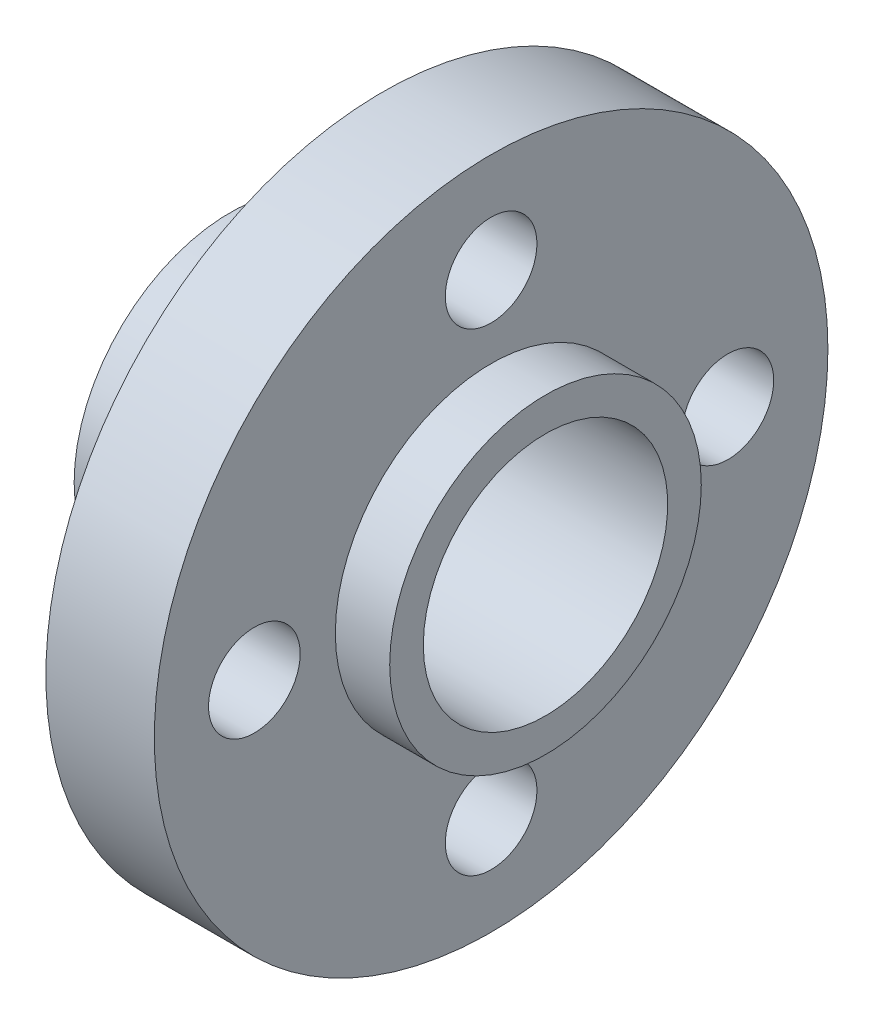
ISO-10303-21;
HEADER;
FILE_DESCRIPTION(('STEP AP214'),'2;1');
FILE_NAME('part.step','',(''),(''),'','','');
FILE_SCHEMA(('AUTOMOTIVE_DESIGN { 1 0 10303 214 1 1 1 1 }'));
ENDSEC;
DATA;
#1=APPLICATION_CONTEXT('core data for automotive mechanical design processes');
#2=APPLICATION_PROTOCOL_DEFINITION('international standard','automotive_design',2000,#1);
#3=PRODUCT_CONTEXT('',#1,'mechanical');
#4=PRODUCT('Part','Part','',(#3));
#5=PRODUCT_RELATED_PRODUCT_CATEGORY('part','',(#4));
#6=PRODUCT_DEFINITION_FORMATION('','',#4);
#7=PRODUCT_DEFINITION_CONTEXT('part definition',#1,'design');
#8=PRODUCT_DEFINITION('design','',#6,#7);
#9=PRODUCT_DEFINITION_SHAPE('','',#8);
#10=(LENGTH_UNIT() NAMED_UNIT(*) SI_UNIT(.MILLI.,.METRE.));
#11=(NAMED_UNIT(*) PLANE_ANGLE_UNIT() SI_UNIT($,.RADIAN.));
#12=(NAMED_UNIT(*) SI_UNIT($,.STERADIAN.) SOLID_ANGLE_UNIT());
#13=UNCERTAINTY_MEASURE_WITH_UNIT(LENGTH_MEASURE(1.E-05),#10,'distance_accuracy_value','');
#14=(GEOMETRIC_REPRESENTATION_CONTEXT(3) GLOBAL_UNCERTAINTY_ASSIGNED_CONTEXT((#13)) GLOBAL_UNIT_ASSIGNED_CONTEXT((#10,
#11,#12)) REPRESENTATION_CONTEXT('',''));
#15=CARTESIAN_POINT('',(0.,0.,0.));
#16=DIRECTION('',(0.,0.,1.));
#17=DIRECTION('',(1.,0.,0.));
#18=AXIS2_PLACEMENT_3D('',#15,#16,#17);
#19=CARTESIAN_POINT('',(3.55,0.,0.));
#20=DIRECTION('',(-1.,0.,0.));
#21=DIRECTION('',(0.,0.,1.));
#22=AXIS2_PLACEMENT_3D('',#19,#20,#21);
#23=CYLINDRICAL_SURFACE('',#22,11.025);
#24=CARTESIAN_POINT('',(3.55,0.,0.));
#25=DIRECTION('',(1.,0.,0.));
#26=DIRECTION('',(0.,0.,-1.));
#27=AXIS2_PLACEMENT_3D('',#24,#25,#26);
#28=CIRCLE('',#27,11.025);
#29=CARTESIAN_POINT('',(3.55,0.,-11.025));
#30=VERTEX_POINT('',#29);
#31=EDGE_CURVE('E39',#30,#30,#28,.T.);
#32=ORIENTED_EDGE('',*,*,#31,.F.);
#33=EDGE_LOOP('',(#32));
#34=FACE_BOUND('',#33,.T.);
#35=CARTESIAN_POINT('',(0.,0.,0.));
#36=DIRECTION('',(1.,0.,0.));
#37=DIRECTION('',(0.,0.,-1.));
#38=AXIS2_PLACEMENT_3D('',#35,#36,#37);
#39=CIRCLE('',#38,11.025);
#40=CARTESIAN_POINT('',(0.,0.,-11.025));
#41=VERTEX_POINT('',#40);
#42=EDGE_CURVE('E43',#41,#41,#39,.T.);
#43=ORIENTED_EDGE('',*,*,#42,.T.);
#44=EDGE_LOOP('',(#43));
#45=FACE_BOUND('',#44,.T.);
#46=ADVANCED_FACE('F33',(#34,#45),#23,.T.);
#47=CARTESIAN_POINT('',(3.55,0.,0.));
#48=DIRECTION('',(1.,0.,0.));
#49=DIRECTION('',(0.,0.,-1.));
#50=AXIS2_PLACEMENT_3D('',#47,#48,#49);
#51=PLANE('',#50);
#52=CARTESIAN_POINT('',(3.55,0.,7.75));
#53=DIRECTION('',(1.,0.,0.));
#54=DIRECTION('',(0.,0.,-1.));
#55=AXIS2_PLACEMENT_3D('',#52,#53,#54);
#56=CIRCLE('',#55,1.5);
#57=CARTESIAN_POINT('',(3.55,0.,6.25));
#58=VERTEX_POINT('',#57);
#59=EDGE_CURVE('E76',#58,#58,#56,.T.);
#60=ORIENTED_EDGE('',*,*,#59,.F.);
#61=EDGE_LOOP('',(#60));
#62=FACE_BOUND('',#61,.T.);
#63=CARTESIAN_POINT('',(3.55,7.75,0.));
#64=DIRECTION('',(1.,0.,0.));
#65=DIRECTION('',(0.,0.,-1.));
#66=AXIS2_PLACEMENT_3D('',#63,#64,#65);
#67=CIRCLE('',#66,1.5);
#68=CARTESIAN_POINT('',(3.55,7.75,-1.50000000000008));
#69=VERTEX_POINT('',#68);
#70=EDGE_CURVE('E79',#69,#69,#67,.T.);
#71=ORIENTED_EDGE('',*,*,#70,.F.);
#72=EDGE_LOOP('',(#71));
#73=FACE_BOUND('',#72,.T.);
#74=CARTESIAN_POINT('',(3.55,-7.75,0.));
#75=DIRECTION('',(1.,0.,0.));
#76=DIRECTION('',(0.,0.,-1.));
#77=AXIS2_PLACEMENT_3D('',#74,#75,#76);
#78=CIRCLE('',#77,1.5);
#79=CARTESIAN_POINT('',(3.55,-7.75,-1.49999999999997));
#80=VERTEX_POINT('',#79);
#81=EDGE_CURVE('E70',#80,#80,#78,.T.);
#82=ORIENTED_EDGE('',*,*,#81,.F.);
#83=EDGE_LOOP('',(#82));
#84=FACE_BOUND('',#83,.T.);
#85=CARTESIAN_POINT('',(3.55,0.,-7.75));
#86=DIRECTION('',(1.,0.,0.));
#87=DIRECTION('',(0.,0.,-1.));
#88=AXIS2_PLACEMENT_3D('',#85,#86,#87);
#89=CIRCLE('',#88,1.5);
#90=CARTESIAN_POINT('',(3.55,0.,-9.25));
#91=VERTEX_POINT('',#90);
#92=EDGE_CURVE('E62',#91,#91,#89,.T.);
#93=ORIENTED_EDGE('',*,*,#92,.F.);
#94=EDGE_LOOP('',(#93));
#95=FACE_BOUND('',#94,.T.);
#96=CARTESIAN_POINT('',(3.55,0.,0.));
#97=DIRECTION('',(1.,0.,0.));
#98=DIRECTION('',(0.,0.,-1.));
#99=AXIS2_PLACEMENT_3D('',#96,#97,#98);
#100=CIRCLE('',#99,5.1);
#101=CARTESIAN_POINT('',(3.55,0.,-5.1));
#102=VERTEX_POINT('',#101);
#103=EDGE_CURVE('E50',#102,#102,#100,.T.);
#104=ORIENTED_EDGE('',*,*,#103,.F.);
#105=EDGE_LOOP('',(#104));
#106=FACE_BOUND('',#105,.T.);
#107=ORIENTED_EDGE('',*,*,#31,.T.);
#108=EDGE_LOOP('',(#107));
#109=FACE_BOUND('',#108,.T.);
#110=ADVANCED_FACE('F95',(#62,#73,#84,#95,#106,#109),#51,.T.);
#111=CARTESIAN_POINT('',(0.,0.,0.));
#112=DIRECTION('',(1.,0.,0.));
#113=DIRECTION('',(0.,0.,-1.));
#114=AXIS2_PLACEMENT_3D('',#111,#112,#113);
#115=PLANE('',#114);
#116=CARTESIAN_POINT('',(0.,0.,7.75));
#117=DIRECTION('',(-1.,0.,0.));
#118=DIRECTION('',(0.,0.,-1.));
#119=AXIS2_PLACEMENT_3D('',#116,#117,#118);
#120=CIRCLE('',#119,1.5);
#121=CARTESIAN_POINT('',(0.,0.,6.25));
#122=VERTEX_POINT('',#121);
#123=EDGE_CURVE('E82',#122,#122,#120,.T.);
#124=ORIENTED_EDGE('',*,*,#123,.F.);
#125=EDGE_LOOP('',(#124));
#126=FACE_BOUND('',#125,.T.);
#127=CARTESIAN_POINT('',(0.,7.75,0.));
#128=DIRECTION('',(-1.,0.,0.));
#129=DIRECTION('',(0.,-1.,0.));
#130=AXIS2_PLACEMENT_3D('',#127,#128,#129);
#131=CIRCLE('',#130,1.5);
#132=CARTESIAN_POINT('',(0.,6.25,0.));
#133=VERTEX_POINT('',#132);
#134=EDGE_CURVE('E83',#133,#133,#131,.T.);
#135=ORIENTED_EDGE('',*,*,#134,.F.);
#136=EDGE_LOOP('',(#135));
#137=FACE_BOUND('',#136,.T.);
#138=CARTESIAN_POINT('',(0.,-7.75,0.));
#139=DIRECTION('',(-1.,0.,0.));
#140=DIRECTION('',(0.,1.,0.));
#141=AXIS2_PLACEMENT_3D('',#138,#139,#140);
#142=CIRCLE('',#141,1.5);
#143=CARTESIAN_POINT('',(0.,-6.25,0.));
#144=VERTEX_POINT('',#143);
#145=EDGE_CURVE('E73',#144,#144,#142,.T.);
#146=ORIENTED_EDGE('',*,*,#145,.F.);
#147=EDGE_LOOP('',(#146));
#148=FACE_BOUND('',#147,.T.);
#149=CARTESIAN_POINT('',(0.,0.,-7.75));
#150=DIRECTION('',(-1.,0.,0.));
#151=DIRECTION('',(0.,0.,1.));
#152=AXIS2_PLACEMENT_3D('',#149,#150,#151);
#153=CIRCLE('',#152,1.5);
#154=CARTESIAN_POINT('',(0.,0.,-6.25));
#155=VERTEX_POINT('',#154);
#156=EDGE_CURVE('E67',#155,#155,#153,.T.);
#157=ORIENTED_EDGE('',*,*,#156,.F.);
#158=EDGE_LOOP('',(#157));
#159=FACE_BOUND('',#158,.T.);
#160=CARTESIAN_POINT('',(0.,0.,0.));
#161=DIRECTION('',(1.,0.,0.));
#162=DIRECTION('',(0.,0.,-1.));
#163=AXIS2_PLACEMENT_3D('',#160,#161,#162);
#164=CIRCLE('',#163,5.1);
#165=CARTESIAN_POINT('',(0.,0.,-5.1));
#166=VERTEX_POINT('',#165);
#167=EDGE_CURVE('E10',#166,#166,#164,.F.);
#168=ORIENTED_EDGE('',*,*,#167,.F.);
#169=EDGE_LOOP('',(#168));
#170=FACE_BOUND('',#169,.T.);
#171=ORIENTED_EDGE('',*,*,#42,.F.);
#172=EDGE_LOOP('',(#171));
#173=FACE_BOUND('',#172,.T.);
#174=ADVANCED_FACE('F91',(#126,#137,#148,#159,#170,#173),#115,.F.);
#175=CARTESIAN_POINT('',(5.33,0.,0.));
#176=DIRECTION('',(-1.,0.,0.));
#177=DIRECTION('',(0.,0.,1.));
#178=AXIS2_PLACEMENT_3D('',#175,#176,#177);
#179=CYLINDRICAL_SURFACE('',#178,5.1);
#180=CARTESIAN_POINT('',(5.33,0.,0.));
#181=DIRECTION('',(1.,0.,0.));
#182=DIRECTION('',(0.,0.,-1.));
#183=AXIS2_PLACEMENT_3D('',#180,#181,#182);
#184=CIRCLE('',#183,5.1);
#185=CARTESIAN_POINT('',(5.33,0.,-5.1));
#186=VERTEX_POINT('',#185);
#187=EDGE_CURVE('E48',#186,#186,#184,.T.);
#188=ORIENTED_EDGE('',*,*,#187,.F.);
#189=EDGE_LOOP('',(#188));
#190=FACE_BOUND('',#189,.T.);
#191=ORIENTED_EDGE('',*,*,#103,.T.);
#192=EDGE_LOOP('',(#191));
#193=FACE_BOUND('',#192,.T.);
#194=ADVANCED_FACE('F94',(#190,#193),#179,.T.);
#195=CARTESIAN_POINT('',(5.33,0.,0.));
#196=DIRECTION('',(1.,0.,0.));
#197=DIRECTION('',(0.,0.,-1.));
#198=AXIS2_PLACEMENT_3D('',#195,#196,#197);
#199=PLANE('',#198);
#200=CARTESIAN_POINT('',(5.33,0.,0.));
#201=DIRECTION('',(-1.,0.,0.));
#202=DIRECTION('',(0.,0.,1.));
#203=AXIS2_PLACEMENT_3D('',#200,#201,#202);
#204=CIRCLE('',#203,4.);
#205=CARTESIAN_POINT('',(5.33,0.,4.));
#206=VERTEX_POINT('',#205);
#207=EDGE_CURVE('E58',#206,#206,#204,.T.);
#208=ORIENTED_EDGE('',*,*,#207,.T.);
#209=EDGE_LOOP('',(#208));
#210=FACE_BOUND('',#209,.T.);
#211=ORIENTED_EDGE('',*,*,#187,.T.);
#212=EDGE_LOOP('',(#211));
#213=FACE_BOUND('',#212,.T.);
#214=ADVANCED_FACE('F119',(#210,#213),#199,.T.);
#215=CARTESIAN_POINT('',(-5.,0.,0.));
#216=DIRECTION('',(1.,0.,0.));
#217=DIRECTION('',(0.,0.,-1.));
#218=AXIS2_PLACEMENT_3D('',#215,#216,#217);
#219=CYLINDRICAL_SURFACE('',#218,5.1);
#220=CARTESIAN_POINT('',(-5.,0.,0.));
#221=DIRECTION('',(-1.,0.,0.));
#222=DIRECTION('',(0.,0.,1.));
#223=AXIS2_PLACEMENT_3D('',#220,#221,#222);
#224=CIRCLE('',#223,5.1);
#225=CARTESIAN_POINT('',(-5.,0.,5.1));
#226=VERTEX_POINT('',#225);
#227=EDGE_CURVE('E53',#226,#226,#224,.T.);
#228=ORIENTED_EDGE('',*,*,#227,.F.);
#229=EDGE_LOOP('',(#228));
#230=FACE_BOUND('',#229,.T.);
#231=ORIENTED_EDGE('',*,*,#167,.T.);
#232=EDGE_LOOP('',(#231));
#233=FACE_BOUND('',#232,.T.);
#234=ADVANCED_FACE('F123',(#230,#233),#219,.T.);
#235=CARTESIAN_POINT('',(-5.,0.,0.));
#236=DIRECTION('',(-1.,0.,0.));
#237=DIRECTION('',(0.,0.,1.));
#238=AXIS2_PLACEMENT_3D('',#235,#236,#237);
#239=PLANE('',#238);
#240=CARTESIAN_POINT('',(-5.,0.,0.));
#241=DIRECTION('',(-1.,0.,0.));
#242=DIRECTION('',(0.,0.,1.));
#243=AXIS2_PLACEMENT_3D('',#240,#241,#242);
#244=CIRCLE('',#243,4.);
#245=CARTESIAN_POINT('',(-5.,0.,4.));
#246=VERTEX_POINT('',#245);
#247=EDGE_CURVE('E59',#246,#246,#244,.T.);
#248=ORIENTED_EDGE('',*,*,#247,.F.);
#249=EDGE_LOOP('',(#248));
#250=FACE_BOUND('',#249,.T.);
#251=ORIENTED_EDGE('',*,*,#227,.T.);
#252=EDGE_LOOP('',(#251));
#253=FACE_BOUND('',#252,.T.);
#254=ADVANCED_FACE('F127',(#250,#253),#239,.T.);
#255=CARTESIAN_POINT('',(5.33,0.,0.));
#256=DIRECTION('',(-1.,0.,0.));
#257=DIRECTION('',(0.,0.,1.));
#258=AXIS2_PLACEMENT_3D('',#255,#256,#257);
#259=CYLINDRICAL_SURFACE('',#258,4.);
#260=ORIENTED_EDGE('',*,*,#207,.F.);
#261=EDGE_LOOP('',(#260));
#262=FACE_BOUND('',#261,.T.);
#263=ORIENTED_EDGE('',*,*,#247,.T.);
#264=EDGE_LOOP('',(#263));
#265=FACE_BOUND('',#264,.T.);
#266=ADVANCED_FACE('F131',(#262,#265),#259,.F.);
#267=CARTESIAN_POINT('',(5.33,0.,-7.75));
#268=DIRECTION('',(-1.,0.,0.));
#269=DIRECTION('',(0.,0.,1.));
#270=AXIS2_PLACEMENT_3D('',#267,#268,#269);
#271=CYLINDRICAL_SURFACE('',#270,1.5);
#272=ORIENTED_EDGE('',*,*,#92,.T.);
#273=EDGE_LOOP('',(#272));
#274=FACE_BOUND('',#273,.T.);
#275=ORIENTED_EDGE('',*,*,#156,.T.);
#276=EDGE_LOOP('',(#275));
#277=FACE_BOUND('',#276,.T.);
#278=ADVANCED_FACE('F135',(#274,#277),#271,.F.);
#279=CARTESIAN_POINT('',(5.33,-7.75,0.));
#280=DIRECTION('',(-1.,0.,0.));
#281=DIRECTION('',(0.,0.,1.));
#282=AXIS2_PLACEMENT_3D('',#279,#280,#281);
#283=CYLINDRICAL_SURFACE('',#282,1.5);
#284=ORIENTED_EDGE('',*,*,#81,.T.);
#285=EDGE_LOOP('',(#284));
#286=FACE_BOUND('',#285,.T.);
#287=ORIENTED_EDGE('',*,*,#145,.T.);
#288=EDGE_LOOP('',(#287));
#289=FACE_BOUND('',#288,.T.);
#290=ADVANCED_FACE('F139',(#286,#289),#283,.F.);
#291=CARTESIAN_POINT('',(5.33,7.75,0.));
#292=DIRECTION('',(-1.,0.,0.));
#293=DIRECTION('',(0.,0.,1.));
#294=AXIS2_PLACEMENT_3D('',#291,#292,#293);
#295=CYLINDRICAL_SURFACE('',#294,1.5);
#296=ORIENTED_EDGE('',*,*,#70,.T.);
#297=EDGE_LOOP('',(#296));
#298=FACE_BOUND('',#297,.T.);
#299=ORIENTED_EDGE('',*,*,#134,.T.);
#300=EDGE_LOOP('',(#299));
#301=FACE_BOUND('',#300,.T.);
#302=ADVANCED_FACE('F143',(#298,#301),#295,.F.);
#303=CARTESIAN_POINT('',(5.33,0.,7.75));
#304=DIRECTION('',(-1.,0.,0.));
#305=DIRECTION('',(0.,0.,1.));
#306=AXIS2_PLACEMENT_3D('',#303,#304,#305);
#307=CYLINDRICAL_SURFACE('',#306,1.5);
#308=ORIENTED_EDGE('',*,*,#59,.T.);
#309=EDGE_LOOP('',(#308));
#310=FACE_BOUND('',#309,.T.);
#311=ORIENTED_EDGE('',*,*,#123,.T.);
#312=EDGE_LOOP('',(#311));
#313=FACE_BOUND('',#312,.T.);
#314=ADVANCED_FACE('F89',(#310,#313),#307,.F.);
#315=CLOSED_SHELL('',(#46,#110,#174,#194,#214,#234,#254,#266,#278,#290,#302,#314));
#316=MANIFOLD_SOLID_BREP('B2',#315);
#317=ADVANCED_BREP_SHAPE_REPRESENTATION('',(#18,#316),#14);
#318=SHAPE_DEFINITION_REPRESENTATION(#9,#317);
ENDSEC;
END-ISO-10303-21;
